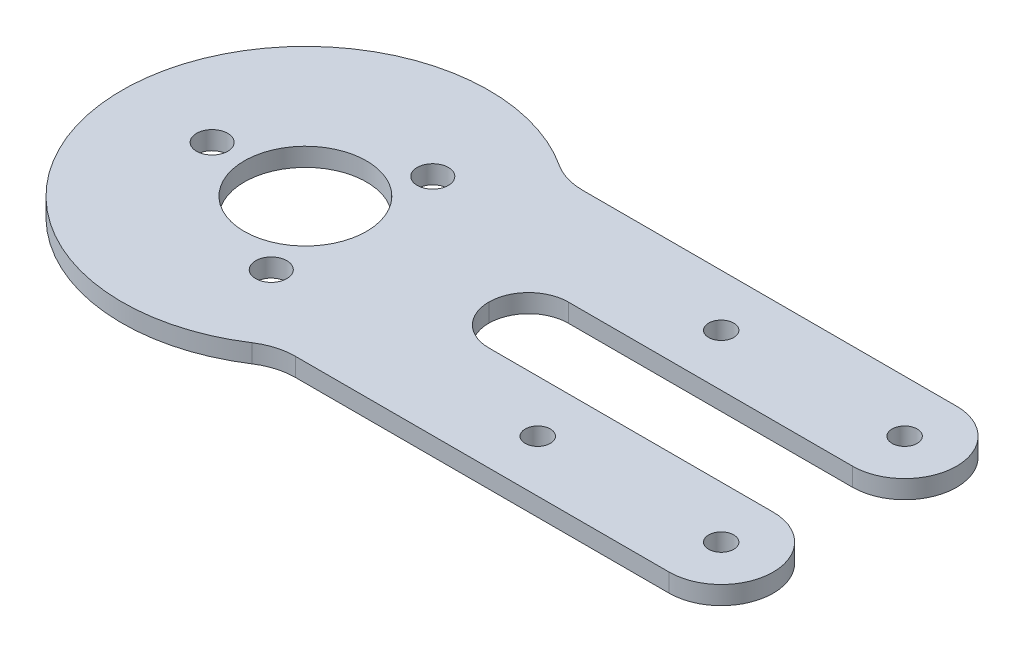
ISO-10303-21;
HEADER;
FILE_DESCRIPTION(('STEP AP214'),'2;1');
FILE_NAME('part.step','',(''),(''),'','','');
FILE_SCHEMA(('AUTOMOTIVE_DESIGN { 1 0 10303 214 1 1 1 1 }'));
ENDSEC;
DATA;
#1=APPLICATION_CONTEXT('core data for automotive mechanical design processes');
#2=APPLICATION_PROTOCOL_DEFINITION('international standard','automotive_design',2000,#1);
#3=PRODUCT_CONTEXT('',#1,'mechanical');
#4=PRODUCT('Part','Part','',(#3));
#5=PRODUCT_RELATED_PRODUCT_CATEGORY('part','',(#4));
#6=PRODUCT_DEFINITION_FORMATION('','',#4);
#7=PRODUCT_DEFINITION_CONTEXT('part definition',#1,'design');
#8=PRODUCT_DEFINITION('design','',#6,#7);
#9=PRODUCT_DEFINITION_SHAPE('','',#8);
#10=(LENGTH_UNIT() NAMED_UNIT(*) SI_UNIT(.MILLI.,.METRE.));
#11=(NAMED_UNIT(*) PLANE_ANGLE_UNIT() SI_UNIT($,.RADIAN.));
#12=(NAMED_UNIT(*) SI_UNIT($,.STERADIAN.) SOLID_ANGLE_UNIT());
#13=UNCERTAINTY_MEASURE_WITH_UNIT(LENGTH_MEASURE(1.E-05),#10,'distance_accuracy_value','');
#14=(GEOMETRIC_REPRESENTATION_CONTEXT(3) GLOBAL_UNCERTAINTY_ASSIGNED_CONTEXT((#13)) GLOBAL_UNIT_ASSIGNED_CONTEXT((#10,
#11,#12)) REPRESENTATION_CONTEXT('',''));
#15=CARTESIAN_POINT('',(0.,0.,0.));
#16=DIRECTION('',(0.,0.,1.));
#17=DIRECTION('',(1.,0.,0.));
#18=AXIS2_PLACEMENT_3D('',#15,#16,#17);
#19=CARTESIAN_POINT('',(18.6480561989715,-83.1091978074972,-23.5));
#20=DIRECTION('',(0.,0.,-1.));
#21=DIRECTION('',(-1.,0.,0.));
#22=AXIS2_PLACEMENT_3D('',#19,#20,#21);
#23=PLANE('',#22);
#24=DIRECTION('',(1.,0.,0.));
#25=VECTOR('',#24,1.);
#26=CARTESIAN_POINT('',(18.6480561989715,0.,-23.5));
#27=LINE('',#26,#25);
#28=CARTESIAN_POINT('',(21.8574929943944,0.,-23.5));
#29=VERTEX_POINT('',#28);
#30=CARTESIAN_POINT('',(83.,0.,-23.5));
#31=VERTEX_POINT('',#30);
#32=EDGE_CURVE('E115',#29,#31,#27,.T.);
#33=ORIENTED_EDGE('',*,*,#32,.F.);
#34=DIRECTION('',(0.,-1.,0.));
#35=VECTOR('',#34,1.);
#36=CARTESIAN_POINT('',(21.8574929943944,-83.1091978074972,-23.5));
#37=LINE('',#36,#35);
#38=CARTESIAN_POINT('',(21.8574929943944,3.,-23.5));
#39=VERTEX_POINT('',#38);
#40=EDGE_CURVE('E206',#29,#39,#37,.F.);
#41=ORIENTED_EDGE('',*,*,#40,.T.);
#42=DIRECTION('',(-1.,0.,0.));
#43=VECTOR('',#42,1.);
#44=CARTESIAN_POINT('',(18.6480561989715,3.,-23.5));
#45=LINE('',#44,#43);
#46=CARTESIAN_POINT('',(83.,3.,-23.5));
#47=VERTEX_POINT('',#46);
#48=EDGE_CURVE('E128',#47,#39,#45,.T.);
#49=ORIENTED_EDGE('',*,*,#48,.F.);
#50=DIRECTION('',(0.,1.,0.));
#51=VECTOR('',#50,1.);
#52=CARTESIAN_POINT('',(83.,0.,-23.5));
#53=LINE('',#52,#51);
#54=EDGE_CURVE('E133',#31,#47,#53,.T.);
#55=ORIENTED_EDGE('',*,*,#54,.F.);
#56=EDGE_LOOP('',(#33,#41,#49,#55));
#57=FACE_BOUND('',#56,.T.);
#58=ADVANCED_FACE('F33',(#57),#23,.T.);
#59=CARTESIAN_POINT('',(29.2873692912149,-83.1091978074972,6.50000000000001));
#60=DIRECTION('',(0.,0.,-1.));
#61=DIRECTION('',(-1.,0.,0.));
#62=AXIS2_PLACEMENT_3D('',#59,#60,#61);
#63=PLANE('',#62);
#64=DIRECTION('',(1.,0.,0.));
#65=VECTOR('',#64,1.);
#66=CARTESIAN_POINT('',(29.2873692912149,0.,6.50000000000001));
#67=LINE('',#66,#65);
#68=CARTESIAN_POINT('',(36.5,0.,6.50000000000001));
#69=VERTEX_POINT('',#68);
#70=CARTESIAN_POINT('',(83.,0.,6.49999999999999));
#71=VERTEX_POINT('',#70);
#72=EDGE_CURVE('E181',#69,#71,#67,.T.);
#73=ORIENTED_EDGE('',*,*,#72,.F.);
#74=DIRECTION('',(0.,-1.,0.));
#75=VECTOR('',#74,1.);
#76=CARTESIAN_POINT('',(36.5,-83.1091978074972,6.50000000000001));
#77=LINE('',#76,#75);
#78=CARTESIAN_POINT('',(36.5,3.,6.50000000000001));
#79=VERTEX_POINT('',#78);
#80=EDGE_CURVE('E215',#69,#79,#77,.F.);
#81=ORIENTED_EDGE('',*,*,#80,.T.);
#82=DIRECTION('',(-1.,0.,0.));
#83=VECTOR('',#82,1.);
#84=CARTESIAN_POINT('',(29.2873692912149,3.,6.50000000000001));
#85=LINE('',#84,#83);
#86=CARTESIAN_POINT('',(83.,3.,6.49999999999999));
#87=VERTEX_POINT('',#86);
#88=EDGE_CURVE('E184',#87,#79,#85,.T.);
#89=ORIENTED_EDGE('',*,*,#88,.F.);
#90=DIRECTION('',(0.,1.,0.));
#91=VECTOR('',#90,1.);
#92=CARTESIAN_POINT('',(83.,0.,6.49999999999999));
#93=LINE('',#92,#91);
#94=EDGE_CURVE('E149',#71,#87,#93,.T.);
#95=ORIENTED_EDGE('',*,*,#94,.F.);
#96=EDGE_LOOP('',(#73,#81,#89,#95));
#97=FACE_BOUND('',#96,.T.);
#98=ADVANCED_FACE('F240',(#97),#63,.T.);
#99=CARTESIAN_POINT('',(0.,3.,0.));
#100=DIRECTION('',(0.,-1.,0.));
#101=DIRECTION('',(0.,0.,-1.));
#102=AXIS2_PLACEMENT_3D('',#99,#100,#101);
#103=CYLINDRICAL_SURFACE('',#102,30.);
#104=CARTESIAN_POINT('',(0.,0.,0.));
#105=DIRECTION('',(0.,1.,0.));
#106=DIRECTION('',(0.,0.,1.));
#107=AXIS2_PLACEMENT_3D('',#104,#105,#106);
#108=CIRCLE('',#107,30.);
#109=CARTESIAN_POINT('',(16.3931197457958,0.,-25.125));
#110=VERTEX_POINT('',#109);
#111=CARTESIAN_POINT('',(16.3931197457958,0.,25.125));
#112=VERTEX_POINT('',#111);
#113=EDGE_CURVE('E193',#110,#112,#108,.T.);
#114=ORIENTED_EDGE('',*,*,#113,.T.);
#115=DIRECTION('',(0.,-1.,0.));
#116=VECTOR('',#115,1.);
#117=CARTESIAN_POINT('',(16.3931197457958,3.,25.125));
#118=LINE('',#117,#116);
#119=CARTESIAN_POINT('',(16.3931197457958,3.,25.125));
#120=VERTEX_POINT('',#119);
#121=EDGE_CURVE('E201',#112,#120,#118,.F.);
#122=ORIENTED_EDGE('',*,*,#121,.T.);
#123=CARTESIAN_POINT('',(0.,3.,0.));
#124=DIRECTION('',(0.,1.,0.));
#125=DIRECTION('',(0.,0.,1.));
#126=AXIS2_PLACEMENT_3D('',#123,#124,#125);
#127=CIRCLE('',#126,30.);
#128=CARTESIAN_POINT('',(16.3931197457958,3.,-25.125));
#129=VERTEX_POINT('',#128);
#130=EDGE_CURVE('E194',#129,#120,#127,.T.);
#131=ORIENTED_EDGE('',*,*,#130,.F.);
#132=DIRECTION('',(0.,-1.,0.));
#133=VECTOR('',#132,1.);
#134=CARTESIAN_POINT('',(16.3931197457958,3.,-25.125));
#135=LINE('',#134,#133);
#136=EDGE_CURVE('E197',#129,#110,#135,.T.);
#137=ORIENTED_EDGE('',*,*,#136,.T.);
#138=EDGE_LOOP('',(#114,#122,#131,#137));
#139=FACE_BOUND('',#138,.T.);
#140=ADVANCED_FACE('F255',(#139),#103,.T.);
#141=CARTESIAN_POINT('',(0.,3.,0.));
#142=DIRECTION('',(0.,1.,0.));
#143=DIRECTION('',(0.,0.,1.));
#144=AXIS2_PLACEMENT_3D('',#141,#142,#143);
#145=PLANE('',#144);
#146=CARTESIAN_POINT('',(0.,3.,0.));
#147=DIRECTION('',(0.,1.,0.));
#148=DIRECTION('',(0.,0.,1.));
#149=AXIS2_PLACEMENT_3D('',#146,#147,#148);
#150=CIRCLE('',#149,10.);
#151=CARTESIAN_POINT('',(0.,3.,10.));
#152=VERTEX_POINT('',#151);
#153=EDGE_CURVE('E279',#152,#152,#150,.T.);
#154=ORIENTED_EDGE('',*,*,#153,.F.);
#155=EDGE_LOOP('',(#154));
#156=FACE_BOUND('',#155,.T.);
#157=CARTESIAN_POINT('',(7.62500000000006,3.,13.2068874077127));
#158=DIRECTION('',(0.,1.,0.));
#159=DIRECTION('',(0.866025403784436,0.,-0.500000000000004));
#160=AXIS2_PLACEMENT_3D('',#157,#158,#159);
#161=CIRCLE('',#160,2.55);
#162=CARTESIAN_POINT('',(9.83336477965038,3.,11.9318874077126));
#163=VERTEX_POINT('',#162);
#164=EDGE_CURVE('E274',#163,#163,#161,.T.);
#165=ORIENTED_EDGE('',*,*,#164,.F.);
#166=EDGE_LOOP('',(#165));
#167=FACE_BOUND('',#166,.T.);
#168=CARTESIAN_POINT('',(7.62499999999988,3.,-13.2068874077128));
#169=DIRECTION('',(0.,1.,0.));
#170=DIRECTION('',(-0.866025403784443,0.,-0.499999999999992));
#171=AXIS2_PLACEMENT_3D('',#168,#169,#170);
#172=CIRCLE('',#171,2.55);
#173=CARTESIAN_POINT('',(5.41663522034955,3.,-14.4818874077127));
#174=VERTEX_POINT('',#173);
#175=EDGE_CURVE('E267',#174,#174,#172,.T.);
#176=ORIENTED_EDGE('',*,*,#175,.F.);
#177=EDGE_LOOP('',(#176));
#178=FACE_BOUND('',#177,.T.);
#179=CARTESIAN_POINT('',(-15.25,3.,0.));
#180=DIRECTION('',(0.,1.,0.));
#181=DIRECTION('',(0.,0.,1.));
#182=AXIS2_PLACEMENT_3D('',#179,#180,#181);
#183=CIRCLE('',#182,2.55);
#184=CARTESIAN_POINT('',(-15.25,3.,2.55));
#185=VERTEX_POINT('',#184);
#186=EDGE_CURVE('E261',#185,#185,#183,.T.);
#187=ORIENTED_EDGE('',*,*,#186,.F.);
#188=EDGE_LOOP('',(#187));
#189=FACE_BOUND('',#188,.T.);
#190=CARTESIAN_POINT('',(83.,3.,-15.));
#191=DIRECTION('',(0.,-1.,0.));
#192=DIRECTION('',(0.,0.,1.));
#193=AXIS2_PLACEMENT_3D('',#190,#191,#192);
#194=CIRCLE('',#193,8.5);
#195=CARTESIAN_POINT('',(83.,3.,-6.49999999999999));
#196=VERTEX_POINT('',#195);
#197=EDGE_CURVE('E137',#47,#196,#194,.T.);
#198=ORIENTED_EDGE('',*,*,#197,.F.);
#199=ORIENTED_EDGE('',*,*,#48,.T.);
#200=CARTESIAN_POINT('',(21.8574929943944,3.,-33.5));
#201=DIRECTION('',(0.,1.,0.));
#202=DIRECTION('',(0.,0.,1.));
#203=AXIS2_PLACEMENT_3D('',#200,#201,#202);
#204=CIRCLE('',#203,10.);
#205=EDGE_CURVE('E212',#39,#129,#204,.F.);
#206=ORIENTED_EDGE('',*,*,#205,.T.);
#207=ORIENTED_EDGE('',*,*,#130,.T.);
#208=CARTESIAN_POINT('',(21.8574929943944,3.,33.5));
#209=DIRECTION('',(0.,1.,0.));
#210=DIRECTION('',(0.,0.,1.));
#211=AXIS2_PLACEMENT_3D('',#208,#209,#210);
#212=CIRCLE('',#211,10.);
#213=CARTESIAN_POINT('',(21.8574929943944,3.,23.5));
#214=VERTEX_POINT('',#213);
#215=EDGE_CURVE('E208',#120,#214,#212,.F.);
#216=ORIENTED_EDGE('',*,*,#215,.T.);
#217=DIRECTION('',(1.,0.,0.));
#218=VECTOR('',#217,1.);
#219=CARTESIAN_POINT('',(18.6480561989715,3.,23.5));
#220=LINE('',#219,#218);
#221=CARTESIAN_POINT('',(83.,3.,23.5));
#222=VERTEX_POINT('',#221);
#223=EDGE_CURVE('E178',#214,#222,#220,.T.);
#224=ORIENTED_EDGE('',*,*,#223,.T.);
#225=CARTESIAN_POINT('',(83.,3.,15.));
#226=DIRECTION('',(0.,-1.,0.));
#227=DIRECTION('',(0.,0.,1.));
#228=AXIS2_PLACEMENT_3D('',#225,#226,#227);
#229=CIRCLE('',#228,8.5);
#230=EDGE_CURVE('E150',#87,#222,#229,.T.);
#231=ORIENTED_EDGE('',*,*,#230,.F.);
#232=ORIENTED_EDGE('',*,*,#88,.T.);
#233=CARTESIAN_POINT('',(36.5,3.,0.));
#234=DIRECTION('',(0.,1.,0.));
#235=DIRECTION('',(0.,0.,1.));
#236=AXIS2_PLACEMENT_3D('',#233,#234,#235);
#237=CIRCLE('',#236,6.5);
#238=CARTESIAN_POINT('',(30.,3.,0.));
#239=VERTEX_POINT('',#238);
#240=EDGE_CURVE('E55',#79,#239,#237,.F.);
#241=ORIENTED_EDGE('',*,*,#240,.T.);
#242=CARTESIAN_POINT('',(36.5,3.,0.));
#243=DIRECTION('',(0.,1.,0.));
#244=DIRECTION('',(0.,0.,1.));
#245=AXIS2_PLACEMENT_3D('',#242,#243,#244);
#246=CIRCLE('',#245,6.5);
#247=CARTESIAN_POINT('',(36.5,3.,-6.50000000000001));
#248=VERTEX_POINT('',#247);
#249=EDGE_CURVE('E42',#239,#248,#246,.F.);
#250=ORIENTED_EDGE('',*,*,#249,.T.);
#251=DIRECTION('',(1.,0.,0.));
#252=VECTOR('',#251,1.);
#253=CARTESIAN_POINT('',(100.,3.,-6.49999999999999));
#254=LINE('',#253,#252);
#255=EDGE_CURVE('E188',#248,#196,#254,.T.);
#256=ORIENTED_EDGE('',*,*,#255,.T.);
#257=EDGE_LOOP('',(#198,#199,#206,#207,#216,#224,#231,#232,#241,#250,#256));
#258=FACE_BOUND('',#257,.T.);
#259=CARTESIAN_POINT('',(53.,3.,15.));
#260=DIRECTION('',(0.,1.,0.));
#261=DIRECTION('',(0.,0.,1.));
#262=AXIS2_PLACEMENT_3D('',#259,#260,#261);
#263=CIRCLE('',#262,2.04999999999999);
#264=CARTESIAN_POINT('',(53.,3.,17.05));
#265=VERTEX_POINT('',#264);
#266=EDGE_CURVE('E142',#265,#265,#263,.T.);
#267=ORIENTED_EDGE('',*,*,#266,.F.);
#268=EDGE_LOOP('',(#267));
#269=FACE_BOUND('',#268,.T.);
#270=CARTESIAN_POINT('',(83.,3.,-15.));
#271=DIRECTION('',(0.,1.,0.));
#272=DIRECTION('',(0.,0.,1.));
#273=AXIS2_PLACEMENT_3D('',#270,#271,#272);
#274=CIRCLE('',#273,2.04999999999999);
#275=CARTESIAN_POINT('',(83.,3.,-12.95));
#276=VERTEX_POINT('',#275);
#277=EDGE_CURVE('E167',#276,#276,#274,.T.);
#278=ORIENTED_EDGE('',*,*,#277,.F.);
#279=EDGE_LOOP('',(#278));
#280=FACE_BOUND('',#279,.T.);
#281=CARTESIAN_POINT('',(83.,3.,15.));
#282=DIRECTION('',(0.,1.,0.));
#283=DIRECTION('',(0.,0.,1.));
#284=AXIS2_PLACEMENT_3D('',#281,#282,#283);
#285=CIRCLE('',#284,2.04999999999999);
#286=CARTESIAN_POINT('',(83.,3.,17.05));
#287=VERTEX_POINT('',#286);
#288=EDGE_CURVE('E161',#287,#287,#285,.T.);
#289=ORIENTED_EDGE('',*,*,#288,.F.);
#290=EDGE_LOOP('',(#289));
#291=FACE_BOUND('',#290,.T.);
#292=CARTESIAN_POINT('',(53.,3.,-15.));
#293=DIRECTION('',(0.,1.,0.));
#294=DIRECTION('',(0.,0.,1.));
#295=AXIS2_PLACEMENT_3D('',#292,#293,#294);
#296=CIRCLE('',#295,2.04999999999999);
#297=CARTESIAN_POINT('',(53.,3.,-12.95));
#298=VERTEX_POINT('',#297);
#299=EDGE_CURVE('E160',#298,#298,#296,.T.);
#300=ORIENTED_EDGE('',*,*,#299,.F.);
#301=EDGE_LOOP('',(#300));
#302=FACE_BOUND('',#301,.T.);
#303=ADVANCED_FACE('F224',(#156,#167,#178,#189,#258,#269,#280,#291,#302),#145,.T.);
#304=CARTESIAN_POINT('',(0.,0.,0.));
#305=DIRECTION('',(0.,1.,0.));
#306=DIRECTION('',(0.,0.,1.));
#307=AXIS2_PLACEMENT_3D('',#304,#305,#306);
#308=PLANE('',#307);
#309=CARTESIAN_POINT('',(0.,0.,0.));
#310=DIRECTION('',(0.,1.,0.));
#311=DIRECTION('',(0.,0.,1.));
#312=AXIS2_PLACEMENT_3D('',#309,#310,#311);
#313=CIRCLE('',#312,10.);
#314=CARTESIAN_POINT('',(0.,0.,10.));
#315=VERTEX_POINT('',#314);
#316=EDGE_CURVE('E271',#315,#315,#313,.T.);
#317=ORIENTED_EDGE('',*,*,#316,.T.);
#318=EDGE_LOOP('',(#317));
#319=FACE_BOUND('',#318,.T.);
#320=CARTESIAN_POINT('',(7.62500000000006,0.,13.2068874077127));
#321=DIRECTION('',(0.,1.,0.));
#322=DIRECTION('',(0.866025403784436,0.,-0.500000000000004));
#323=AXIS2_PLACEMENT_3D('',#320,#321,#322);
#324=CIRCLE('',#323,2.55);
#325=CARTESIAN_POINT('',(9.83336477965038,0.,11.9318874077126));
#326=VERTEX_POINT('',#325);
#327=EDGE_CURVE('E264',#326,#326,#324,.T.);
#328=ORIENTED_EDGE('',*,*,#327,.T.);
#329=EDGE_LOOP('',(#328));
#330=FACE_BOUND('',#329,.T.);
#331=CARTESIAN_POINT('',(7.62499999999988,0.,-13.2068874077128));
#332=DIRECTION('',(0.,1.,0.));
#333=DIRECTION('',(-0.866025403784443,0.,-0.499999999999992));
#334=AXIS2_PLACEMENT_3D('',#331,#332,#333);
#335=CIRCLE('',#334,2.55);
#336=CARTESIAN_POINT('',(5.41663522034955,0.,-14.4818874077127));
#337=VERTEX_POINT('',#336);
#338=EDGE_CURVE('E270',#337,#337,#335,.T.);
#339=ORIENTED_EDGE('',*,*,#338,.T.);
#340=EDGE_LOOP('',(#339));
#341=FACE_BOUND('',#340,.T.);
#342=CARTESIAN_POINT('',(-15.25,0.,0.));
#343=DIRECTION('',(0.,1.,0.));
#344=DIRECTION('',(0.,0.,1.));
#345=AXIS2_PLACEMENT_3D('',#342,#343,#344);
#346=CIRCLE('',#345,2.55);
#347=CARTESIAN_POINT('',(-15.25,0.,2.55));
#348=VERTEX_POINT('',#347);
#349=EDGE_CURVE('E233',#348,#348,#346,.T.);
#350=ORIENTED_EDGE('',*,*,#349,.T.);
#351=EDGE_LOOP('',(#350));
#352=FACE_BOUND('',#351,.T.);
#353=CARTESIAN_POINT('',(53.,0.,15.));
#354=DIRECTION('',(0.,1.,0.));
#355=DIRECTION('',(0.,0.,1.));
#356=AXIS2_PLACEMENT_3D('',#353,#354,#355);
#357=CIRCLE('',#356,2.04999999999999);
#358=CARTESIAN_POINT('',(53.,0.,17.05));
#359=VERTEX_POINT('',#358);
#360=EDGE_CURVE('E170',#359,#359,#357,.T.);
#361=ORIENTED_EDGE('',*,*,#360,.T.);
#362=EDGE_LOOP('',(#361));
#363=FACE_BOUND('',#362,.T.);
#364=CARTESIAN_POINT('',(83.,0.,-15.));
#365=DIRECTION('',(0.,1.,0.));
#366=DIRECTION('',(0.,0.,1.));
#367=AXIS2_PLACEMENT_3D('',#364,#365,#366);
#368=CIRCLE('',#367,2.04999999999999);
#369=CARTESIAN_POINT('',(83.,0.,-12.95));
#370=VERTEX_POINT('',#369);
#371=EDGE_CURVE('E164',#370,#370,#368,.T.);
#372=ORIENTED_EDGE('',*,*,#371,.T.);
#373=EDGE_LOOP('',(#372));
#374=FACE_BOUND('',#373,.T.);
#375=CARTESIAN_POINT('',(83.,0.,15.));
#376=DIRECTION('',(0.,1.,0.));
#377=DIRECTION('',(0.,0.,1.));
#378=AXIS2_PLACEMENT_3D('',#375,#376,#377);
#379=CIRCLE('',#378,2.04999999999999);
#380=CARTESIAN_POINT('',(83.,0.,17.05));
#381=VERTEX_POINT('',#380);
#382=EDGE_CURVE('E157',#381,#381,#379,.T.);
#383=ORIENTED_EDGE('',*,*,#382,.T.);
#384=EDGE_LOOP('',(#383));
#385=FACE_BOUND('',#384,.T.);
#386=CARTESIAN_POINT('',(53.,0.,-15.));
#387=DIRECTION('',(0.,1.,0.));
#388=DIRECTION('',(0.,0.,1.));
#389=AXIS2_PLACEMENT_3D('',#386,#387,#388);
#390=CIRCLE('',#389,2.04999999999999);
#391=CARTESIAN_POINT('',(53.,0.,-12.95));
#392=VERTEX_POINT('',#391);
#393=EDGE_CURVE('E175',#392,#392,#390,.T.);
#394=ORIENTED_EDGE('',*,*,#393,.T.);
#395=EDGE_LOOP('',(#394));
#396=FACE_BOUND('',#395,.T.);
#397=ORIENTED_EDGE('',*,*,#113,.F.);
#398=CARTESIAN_POINT('',(21.8574929943944,0.,-33.5));
#399=DIRECTION('',(0.,1.,0.));
#400=DIRECTION('',(0.,0.,1.));
#401=AXIS2_PLACEMENT_3D('',#398,#399,#400);
#402=CIRCLE('',#401,10.);
#403=EDGE_CURVE('E122',#110,#29,#402,.T.);
#404=ORIENTED_EDGE('',*,*,#403,.T.);
#405=ORIENTED_EDGE('',*,*,#32,.T.);
#406=CARTESIAN_POINT('',(83.,0.,-15.));
#407=DIRECTION('',(0.,-1.,0.));
#408=DIRECTION('',(0.,0.,1.));
#409=AXIS2_PLACEMENT_3D('',#406,#407,#408);
#410=CIRCLE('',#409,8.5);
#411=CARTESIAN_POINT('',(83.,0.,-6.49999999999999));
#412=VERTEX_POINT('',#411);
#413=EDGE_CURVE('E119',#31,#412,#410,.T.);
#414=ORIENTED_EDGE('',*,*,#413,.T.);
#415=DIRECTION('',(-1.,0.,0.));
#416=VECTOR('',#415,1.);
#417=CARTESIAN_POINT('',(100.,0.,-6.49999999999999));
#418=LINE('',#417,#416);
#419=CARTESIAN_POINT('',(36.5,0.,-6.50000000000001));
#420=VERTEX_POINT('',#419);
#421=EDGE_CURVE('E127',#412,#420,#418,.T.);
#422=ORIENTED_EDGE('',*,*,#421,.T.);
#423=CARTESIAN_POINT('',(36.5,0.,0.));
#424=DIRECTION('',(0.,1.,0.));
#425=DIRECTION('',(0.,0.,1.));
#426=AXIS2_PLACEMENT_3D('',#423,#424,#425);
#427=CIRCLE('',#426,6.5);
#428=CARTESIAN_POINT('',(30.,0.,0.));
#429=VERTEX_POINT('',#428);
#430=EDGE_CURVE('E11',#420,#429,#427,.T.);
#431=ORIENTED_EDGE('',*,*,#430,.T.);
#432=CARTESIAN_POINT('',(36.5,0.,0.));
#433=DIRECTION('',(0.,1.,0.));
#434=DIRECTION('',(0.,0.,1.));
#435=AXIS2_PLACEMENT_3D('',#432,#433,#434);
#436=CIRCLE('',#435,6.5);
#437=EDGE_CURVE('E221',#429,#69,#436,.T.);
#438=ORIENTED_EDGE('',*,*,#437,.T.);
#439=ORIENTED_EDGE('',*,*,#72,.T.);
#440=CARTESIAN_POINT('',(83.,0.,15.));
#441=DIRECTION('',(0.,-1.,0.));
#442=DIRECTION('',(0.,0.,1.));
#443=AXIS2_PLACEMENT_3D('',#440,#441,#442);
#444=CIRCLE('',#443,8.5);
#445=CARTESIAN_POINT('',(83.,0.,23.5));
#446=VERTEX_POINT('',#445);
#447=EDGE_CURVE('E146',#71,#446,#444,.T.);
#448=ORIENTED_EDGE('',*,*,#447,.T.);
#449=DIRECTION('',(-1.,0.,0.));
#450=VECTOR('',#449,1.);
#451=CARTESIAN_POINT('',(18.6480561989715,0.,23.5));
#452=LINE('',#451,#450);
#453=CARTESIAN_POINT('',(21.8574929943944,0.,23.5));
#454=VERTEX_POINT('',#453);
#455=EDGE_CURVE('E183',#446,#454,#452,.T.);
#456=ORIENTED_EDGE('',*,*,#455,.T.);
#457=CARTESIAN_POINT('',(21.8574929943944,0.,33.5));
#458=DIRECTION('',(0.,1.,0.));
#459=DIRECTION('',(0.,0.,1.));
#460=AXIS2_PLACEMENT_3D('',#457,#458,#459);
#461=CIRCLE('',#460,10.);
#462=EDGE_CURVE('E210',#454,#112,#461,.T.);
#463=ORIENTED_EDGE('',*,*,#462,.T.);
#464=EDGE_LOOP('',(#397,#404,#405,#414,#422,#431,#438,#439,#448,#456,#463));
#465=FACE_BOUND('',#464,.T.);
#466=ADVANCED_FACE('F118',(#319,#330,#341,#352,#363,#374,#385,#396,#465),#308,.F.);
#467=CARTESIAN_POINT('',(100.,-83.1091978074972,-6.49999999999999));
#468=DIRECTION('',(0.,0.,1.));
#469=DIRECTION('',(1.,0.,0.));
#470=AXIS2_PLACEMENT_3D('',#467,#468,#469);
#471=PLANE('',#470);
#472=ORIENTED_EDGE('',*,*,#255,.F.);
#473=DIRECTION('',(0.,-1.,0.));
#474=VECTOR('',#473,1.);
#475=CARTESIAN_POINT('',(36.5,-83.1091978074972,-6.50000000000001));
#476=LINE('',#475,#474);
#477=EDGE_CURVE('E218',#248,#420,#476,.T.);
#478=ORIENTED_EDGE('',*,*,#477,.T.);
#479=ORIENTED_EDGE('',*,*,#421,.F.);
#480=DIRECTION('',(0.,1.,0.));
#481=VECTOR('',#480,1.);
#482=CARTESIAN_POINT('',(83.,0.,-6.49999999999999));
#483=LINE('',#482,#481);
#484=EDGE_CURVE('E136',#412,#196,#483,.T.);
#485=ORIENTED_EDGE('',*,*,#484,.T.);
#486=EDGE_LOOP('',(#472,#478,#479,#485));
#487=FACE_BOUND('',#486,.T.);
#488=ADVANCED_FACE('F230',(#487),#471,.T.);
#489=CARTESIAN_POINT('',(18.6480561989715,-83.1091978074972,23.5));
#490=DIRECTION('',(0.,0.,1.));
#491=DIRECTION('',(1.,0.,0.));
#492=AXIS2_PLACEMENT_3D('',#489,#490,#491);
#493=PLANE('',#492);
#494=ORIENTED_EDGE('',*,*,#223,.F.);
#495=DIRECTION('',(0.,-1.,0.));
#496=VECTOR('',#495,1.);
#497=CARTESIAN_POINT('',(21.8574929943944,-83.1091978074972,23.5));
#498=LINE('',#497,#496);
#499=EDGE_CURVE('E204',#214,#454,#498,.T.);
#500=ORIENTED_EDGE('',*,*,#499,.T.);
#501=ORIENTED_EDGE('',*,*,#455,.F.);
#502=DIRECTION('',(0.,1.,0.));
#503=VECTOR('',#502,1.);
#504=CARTESIAN_POINT('',(83.,0.,23.5));
#505=LINE('',#504,#503);
#506=EDGE_CURVE('E153',#446,#222,#505,.T.);
#507=ORIENTED_EDGE('',*,*,#506,.T.);
#508=EDGE_LOOP('',(#494,#500,#501,#507));
#509=FACE_BOUND('',#508,.T.);
#510=ADVANCED_FACE('F248',(#509),#493,.T.);
#511=CARTESIAN_POINT('',(53.,0.,-15.));
#512=DIRECTION('',(0.,1.,0.));
#513=DIRECTION('',(0.,0.,1.));
#514=AXIS2_PLACEMENT_3D('',#511,#512,#513);
#515=CYLINDRICAL_SURFACE('',#514,2.04999999999999);
#516=ORIENTED_EDGE('',*,*,#393,.F.);
#517=EDGE_LOOP('',(#516));
#518=FACE_BOUND('',#517,.T.);
#519=ORIENTED_EDGE('',*,*,#299,.T.);
#520=EDGE_LOOP('',(#519));
#521=FACE_BOUND('',#520,.T.);
#522=ADVANCED_FACE('F391',(#518,#521),#515,.F.);
#523=CARTESIAN_POINT('',(83.,0.,15.));
#524=DIRECTION('',(0.,1.,0.));
#525=DIRECTION('',(0.,0.,1.));
#526=AXIS2_PLACEMENT_3D('',#523,#524,#525);
#527=CYLINDRICAL_SURFACE('',#526,2.04999999999999);
#528=ORIENTED_EDGE('',*,*,#382,.F.);
#529=EDGE_LOOP('',(#528));
#530=FACE_BOUND('',#529,.T.);
#531=ORIENTED_EDGE('',*,*,#288,.T.);
#532=EDGE_LOOP('',(#531));
#533=FACE_BOUND('',#532,.T.);
#534=ADVANCED_FACE('F399',(#530,#533),#527,.F.);
#535=CARTESIAN_POINT('',(83.,0.,-15.));
#536=DIRECTION('',(0.,1.,0.));
#537=DIRECTION('',(0.,0.,1.));
#538=AXIS2_PLACEMENT_3D('',#535,#536,#537);
#539=CYLINDRICAL_SURFACE('',#538,2.04999999999999);
#540=ORIENTED_EDGE('',*,*,#371,.F.);
#541=EDGE_LOOP('',(#540));
#542=FACE_BOUND('',#541,.T.);
#543=ORIENTED_EDGE('',*,*,#277,.T.);
#544=EDGE_LOOP('',(#543));
#545=FACE_BOUND('',#544,.T.);
#546=ADVANCED_FACE('F407',(#542,#545),#539,.F.);
#547=CARTESIAN_POINT('',(53.,0.,15.));
#548=DIRECTION('',(0.,1.,0.));
#549=DIRECTION('',(0.,0.,1.));
#550=AXIS2_PLACEMENT_3D('',#547,#548,#549);
#551=CYLINDRICAL_SURFACE('',#550,2.04999999999999);
#552=ORIENTED_EDGE('',*,*,#360,.F.);
#553=EDGE_LOOP('',(#552));
#554=FACE_BOUND('',#553,.T.);
#555=ORIENTED_EDGE('',*,*,#266,.T.);
#556=EDGE_LOOP('',(#555));
#557=FACE_BOUND('',#556,.T.);
#558=ADVANCED_FACE('F415',(#554,#557),#551,.F.);
#559=CARTESIAN_POINT('',(83.,0.,15.));
#560=DIRECTION('',(0.,1.,0.));
#561=DIRECTION('',(0.,0.,1.));
#562=AXIS2_PLACEMENT_3D('',#559,#560,#561);
#563=CYLINDRICAL_SURFACE('',#562,8.5);
#564=ORIENTED_EDGE('',*,*,#230,.T.);
#565=ORIENTED_EDGE('',*,*,#506,.F.);
#566=ORIENTED_EDGE('',*,*,#447,.F.);
#567=ORIENTED_EDGE('',*,*,#94,.T.);
#568=EDGE_LOOP('',(#564,#565,#566,#567));
#569=FACE_BOUND('',#568,.T.);
#570=ADVANCED_FACE('F244',(#569),#563,.T.);
#571=CARTESIAN_POINT('',(83.,0.,-15.));
#572=DIRECTION('',(0.,1.,0.));
#573=DIRECTION('',(0.,0.,1.));
#574=AXIS2_PLACEMENT_3D('',#571,#572,#573);
#575=CYLINDRICAL_SURFACE('',#574,8.5);
#576=ORIENTED_EDGE('',*,*,#197,.T.);
#577=ORIENTED_EDGE('',*,*,#484,.F.);
#578=ORIENTED_EDGE('',*,*,#413,.F.);
#579=ORIENTED_EDGE('',*,*,#54,.T.);
#580=EDGE_LOOP('',(#576,#577,#578,#579));
#581=FACE_BOUND('',#580,.T.);
#582=ADVANCED_FACE('F132',(#581),#575,.T.);
#583=CARTESIAN_POINT('',(21.8574929943944,3.,33.5));
#584=DIRECTION('',(0.,-1.,0.));
#585=DIRECTION('',(0.,0.,-1.));
#586=AXIS2_PLACEMENT_3D('',#583,#584,#585);
#587=CYLINDRICAL_SURFACE('',#586,10.);
#588=ORIENTED_EDGE('',*,*,#462,.F.);
#589=ORIENTED_EDGE('',*,*,#499,.F.);
#590=ORIENTED_EDGE('',*,*,#215,.F.);
#591=ORIENTED_EDGE('',*,*,#121,.F.);
#592=EDGE_LOOP('',(#588,#589,#590,#591));
#593=FACE_BOUND('',#592,.T.);
#594=ADVANCED_FACE('F252',(#593),#587,.F.);
#595=CARTESIAN_POINT('',(21.8574929943944,3.,-33.5));
#596=DIRECTION('',(0.,-1.,0.));
#597=DIRECTION('',(0.,0.,-1.));
#598=AXIS2_PLACEMENT_3D('',#595,#596,#597);
#599=CYLINDRICAL_SURFACE('',#598,10.);
#600=ORIENTED_EDGE('',*,*,#403,.F.);
#601=ORIENTED_EDGE('',*,*,#136,.F.);
#602=ORIENTED_EDGE('',*,*,#205,.F.);
#603=ORIENTED_EDGE('',*,*,#40,.F.);
#604=EDGE_LOOP('',(#600,#601,#602,#603));
#605=FACE_BOUND('',#604,.T.);
#606=ADVANCED_FACE('F259',(#605),#599,.F.);
#607=CARTESIAN_POINT('',(36.5,3.,0.));
#608=DIRECTION('',(0.,-1.,0.));
#609=DIRECTION('',(0.,0.,-1.));
#610=AXIS2_PLACEMENT_3D('',#607,#608,#609);
#611=CYLINDRICAL_SURFACE('',#610,6.5);
#612=DIRECTION('',(0.,-1.,0.));
#613=VECTOR('',#612,1.);
#614=CARTESIAN_POINT('',(30.,3.,0.));
#615=LINE('',#614,#613);
#616=EDGE_CURVE('E37',#429,#239,#615,.F.);
#617=ORIENTED_EDGE('',*,*,#616,.F.);
#618=ORIENTED_EDGE('',*,*,#430,.F.);
#619=ORIENTED_EDGE('',*,*,#477,.F.);
#620=ORIENTED_EDGE('',*,*,#249,.F.);
#621=EDGE_LOOP('',(#617,#618,#619,#620));
#622=FACE_BOUND('',#621,.T.);
#623=ADVANCED_FACE('F35',(#622),#611,.F.);
#624=CARTESIAN_POINT('',(36.5,3.,0.));
#625=DIRECTION('',(0.,-1.,0.));
#626=DIRECTION('',(0.,0.,-1.));
#627=AXIS2_PLACEMENT_3D('',#624,#625,#626);
#628=CYLINDRICAL_SURFACE('',#627,6.5);
#629=ORIENTED_EDGE('',*,*,#437,.F.);
#630=ORIENTED_EDGE('',*,*,#616,.T.);
#631=ORIENTED_EDGE('',*,*,#240,.F.);
#632=ORIENTED_EDGE('',*,*,#80,.F.);
#633=EDGE_LOOP('',(#629,#630,#631,#632));
#634=FACE_BOUND('',#633,.T.);
#635=ADVANCED_FACE('F235',(#634),#628,.F.);
#636=CARTESIAN_POINT('',(-15.25,0.,0.));
#637=DIRECTION('',(0.,1.,0.));
#638=DIRECTION('',(0.,0.,1.));
#639=AXIS2_PLACEMENT_3D('',#636,#637,#638);
#640=CYLINDRICAL_SURFACE('',#639,2.55);
#641=ORIENTED_EDGE('',*,*,#349,.F.);
#642=EDGE_LOOP('',(#641));
#643=FACE_BOUND('',#642,.T.);
#644=ORIENTED_EDGE('',*,*,#186,.T.);
#645=EDGE_LOOP('',(#644));
#646=FACE_BOUND('',#645,.T.);
#647=ADVANCED_FACE('F303',(#643,#646),#640,.F.);
#648=CARTESIAN_POINT('',(7.62499999999988,0.,-13.2068874077128));
#649=DIRECTION('',(0.,1.,0.));
#650=DIRECTION('',(0.,0.,1.));
#651=AXIS2_PLACEMENT_3D('',#648,#649,#650);
#652=CYLINDRICAL_SURFACE('',#651,2.55);
#653=ORIENTED_EDGE('',*,*,#338,.F.);
#654=EDGE_LOOP('',(#653));
#655=FACE_BOUND('',#654,.T.);
#656=ORIENTED_EDGE('',*,*,#175,.T.);
#657=EDGE_LOOP('',(#656));
#658=FACE_BOUND('',#657,.T.);
#659=ADVANCED_FACE('F305',(#655,#658),#652,.F.);
#660=CARTESIAN_POINT('',(7.62500000000006,0.,13.2068874077127));
#661=DIRECTION('',(0.,1.,0.));
#662=DIRECTION('',(0.,0.,1.));
#663=AXIS2_PLACEMENT_3D('',#660,#661,#662);
#664=CYLINDRICAL_SURFACE('',#663,2.55);
#665=ORIENTED_EDGE('',*,*,#327,.F.);
#666=EDGE_LOOP('',(#665));
#667=FACE_BOUND('',#666,.T.);
#668=ORIENTED_EDGE('',*,*,#164,.T.);
#669=EDGE_LOOP('',(#668));
#670=FACE_BOUND('',#669,.T.);
#671=ADVANCED_FACE('F290',(#667,#670),#664,.F.);
#672=CARTESIAN_POINT('',(0.,0.,0.));
#673=DIRECTION('',(0.,1.,0.));
#674=DIRECTION('',(0.,0.,1.));
#675=AXIS2_PLACEMENT_3D('',#672,#673,#674);
#676=CYLINDRICAL_SURFACE('',#675,10.);
#677=ORIENTED_EDGE('',*,*,#316,.F.);
#678=EDGE_LOOP('',(#677));
#679=FACE_BOUND('',#678,.T.);
#680=ORIENTED_EDGE('',*,*,#153,.T.);
#681=EDGE_LOOP('',(#680));
#682=FACE_BOUND('',#681,.T.);
#683=ADVANCED_FACE('F287',(#679,#682),#676,.F.);
#684=CLOSED_SHELL('',(#58,#98,#140,#303,#466,#488,#510,#522,#534,#546,#558,#570,#582,#594,#606,
#623,#635,#647,#659,#671,#683));
#685=MANIFOLD_SOLID_BREP('B2',#684);
#686=ADVANCED_BREP_SHAPE_REPRESENTATION('',(#18,#685),#14);
#687=SHAPE_DEFINITION_REPRESENTATION(#9,#686);
ENDSEC;
END-ISO-10303-21;
